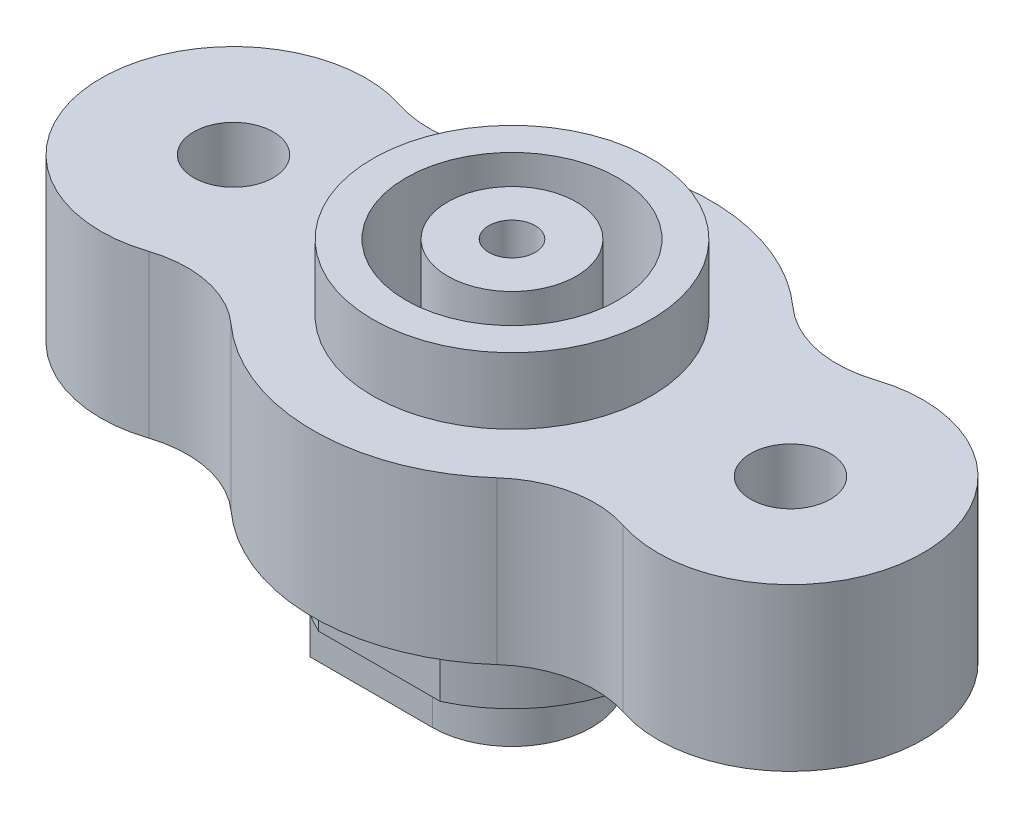
ISO-10303-21;
HEADER;
FILE_DESCRIPTION(('STEP AP214'),'2;1');
FILE_NAME('part.step','',(''),(''),'','','');
FILE_SCHEMA(('AUTOMOTIVE_DESIGN { 1 0 10303 214 1 1 1 1 }'));
ENDSEC;
DATA;
#1=APPLICATION_CONTEXT('core data for automotive mechanical design processes');
#2=APPLICATION_PROTOCOL_DEFINITION('international standard','automotive_design',2000,#1);
#3=PRODUCT_CONTEXT('',#1,'mechanical');
#4=PRODUCT('Part','Part','',(#3));
#5=PRODUCT_RELATED_PRODUCT_CATEGORY('part','',(#4));
#6=PRODUCT_DEFINITION_FORMATION('','',#4);
#7=PRODUCT_DEFINITION_CONTEXT('part definition',#1,'design');
#8=PRODUCT_DEFINITION('design','',#6,#7);
#9=PRODUCT_DEFINITION_SHAPE('','',#8);
#10=(LENGTH_UNIT() NAMED_UNIT(*) SI_UNIT(.MILLI.,.METRE.));
#11=(NAMED_UNIT(*) PLANE_ANGLE_UNIT() SI_UNIT($,.RADIAN.));
#12=(NAMED_UNIT(*) SI_UNIT($,.STERADIAN.) SOLID_ANGLE_UNIT());
#13=UNCERTAINTY_MEASURE_WITH_UNIT(LENGTH_MEASURE(1.E-05),#10,'distance_accuracy_value','');
#14=(GEOMETRIC_REPRESENTATION_CONTEXT(3) GLOBAL_UNCERTAINTY_ASSIGNED_CONTEXT((#13)) GLOBAL_UNIT_ASSIGNED_CONTEXT((#10,
#11,#12)) REPRESENTATION_CONTEXT('',''));
#15=CARTESIAN_POINT('',(0.,0.,0.));
#16=DIRECTION('',(0.,0.,1.));
#17=DIRECTION('',(1.,0.,0.));
#18=AXIS2_PLACEMENT_3D('',#15,#16,#17);
#19=CARTESIAN_POINT('',(0.,0.,0.));
#20=DIRECTION('',(0.,1.,0.));
#21=DIRECTION('',(0.,0.,1.));
#22=AXIS2_PLACEMENT_3D('',#19,#20,#21);
#23=PLANE('',#22);
#24=CARTESIAN_POINT('',(10.5,0.,0.));
#25=DIRECTION('',(0.,1.,0.));
#26=DIRECTION('',(0.,0.,1.));
#27=AXIS2_PLACEMENT_3D('',#24,#25,#26);
#28=CIRCLE('',#27,1.5);
#29=CARTESIAN_POINT('',(10.5,0.,1.5));
#30=VERTEX_POINT('',#29);
#31=EDGE_CURVE('E237',#30,#30,#28,.F.);
#32=ORIENTED_EDGE('',*,*,#31,.F.);
#33=EDGE_LOOP('',(#32));
#34=FACE_BOUND('',#33,.T.);
#35=CARTESIAN_POINT('',(-10.5,0.,0.));
#36=DIRECTION('',(0.,1.,0.));
#37=DIRECTION('',(0.,0.,1.));
#38=AXIS2_PLACEMENT_3D('',#35,#36,#37);
#39=CIRCLE('',#38,5.);
#40=CARTESIAN_POINT('',(-8.93915343915344,0.,-4.75013242062718));
#41=VERTEX_POINT('',#40);
#42=CARTESIAN_POINT('',(-8.93915343915344,0.,4.75013242062718));
#43=VERTEX_POINT('',#42);
#44=EDGE_CURVE('E253',#41,#43,#39,.T.);
#45=ORIENTED_EDGE('',*,*,#44,.F.);
#46=CARTESIAN_POINT('',(-7.69047619047619,0.,-8.55023835712893));
#47=DIRECTION('',(0.,1.,0.));
#48=DIRECTION('',(0.,0.,1.));
#49=AXIS2_PLACEMENT_3D('',#46,#47,#48);
#50=CIRCLE('',#49,4.);
#51=CARTESIAN_POINT('',(-5.01552795031056,0.,-5.57624240682321));
#52=VERTEX_POINT('',#51);
#53=EDGE_CURVE('E49',#41,#52,#50,.T.);
#54=ORIENTED_EDGE('',*,*,#53,.T.);
#55=CARTESIAN_POINT('',(0.,0.,0.));
#56=DIRECTION('',(0.,1.,0.));
#57=DIRECTION('',(0.,0.,1.));
#58=AXIS2_PLACEMENT_3D('',#55,#56,#57);
#59=CIRCLE('',#58,7.5);
#60=CARTESIAN_POINT('',(5.01552795031056,0.,-5.57624240682321));
#61=VERTEX_POINT('',#60);
#62=EDGE_CURVE('E257',#61,#52,#59,.T.);
#63=ORIENTED_EDGE('',*,*,#62,.F.);
#64=CARTESIAN_POINT('',(7.69047619047619,0.,-8.55023835712893));
#65=DIRECTION('',(0.,1.,0.));
#66=DIRECTION('',(0.,0.,1.));
#67=AXIS2_PLACEMENT_3D('',#64,#65,#66);
#68=CIRCLE('',#67,4.);
#69=CARTESIAN_POINT('',(8.93915343915344,0.,-4.75013242062718));
#70=VERTEX_POINT('',#69);
#71=EDGE_CURVE('E292',#61,#70,#68,.T.);
#72=ORIENTED_EDGE('',*,*,#71,.T.);
#73=CARTESIAN_POINT('',(10.5,0.,0.));
#74=DIRECTION('',(0.,1.,0.));
#75=DIRECTION('',(0.,0.,1.));
#76=AXIS2_PLACEMENT_3D('',#73,#74,#75);
#77=CIRCLE('',#76,5.);
#78=CARTESIAN_POINT('',(8.93915343915344,0.,4.75013242062718));
#79=VERTEX_POINT('',#78);
#80=EDGE_CURVE('E260',#70,#79,#77,.F.);
#81=ORIENTED_EDGE('',*,*,#80,.T.);
#82=CARTESIAN_POINT('',(7.69047619047619,0.,8.55023835712893));
#83=DIRECTION('',(0.,1.,0.));
#84=DIRECTION('',(0.,0.,1.));
#85=AXIS2_PLACEMENT_3D('',#82,#83,#84);
#86=CIRCLE('',#85,4.);
#87=CARTESIAN_POINT('',(5.01552795031056,0.,5.57624240682321));
#88=VERTEX_POINT('',#87);
#89=EDGE_CURVE('E284',#79,#88,#86,.T.);
#90=ORIENTED_EDGE('',*,*,#89,.T.);
#91=CARTESIAN_POINT('',(-5.01552795031056,0.,5.57624240682321));
#92=VERTEX_POINT('',#91);
#93=EDGE_CURVE('E256',#92,#88,#59,.T.);
#94=ORIENTED_EDGE('',*,*,#93,.F.);
#95=CARTESIAN_POINT('',(-7.69047619047619,0.,8.55023835712893));
#96=DIRECTION('',(0.,1.,0.));
#97=DIRECTION('',(0.,0.,1.));
#98=AXIS2_PLACEMENT_3D('',#95,#96,#97);
#99=CIRCLE('',#98,4.);
#100=EDGE_CURVE('E288',#92,#43,#99,.T.);
#101=ORIENTED_EDGE('',*,*,#100,.T.);
#102=EDGE_LOOP('',(#45,#54,#63,#72,#81,#90,#94,#101));
#103=FACE_BOUND('',#102,.T.);
#104=CARTESIAN_POINT('',(-10.5,0.,0.));
#105=DIRECTION('',(0.,1.,0.));
#106=DIRECTION('',(0.,0.,1.));
#107=AXIS2_PLACEMENT_3D('',#104,#105,#106);
#108=CIRCLE('',#107,1.5);
#109=CARTESIAN_POINT('',(-10.5,0.,1.5));
#110=VERTEX_POINT('',#109);
#111=EDGE_CURVE('E230',#110,#110,#108,.T.);
#112=ORIENTED_EDGE('',*,*,#111,.T.);
#113=EDGE_LOOP('',(#112));
#114=FACE_BOUND('',#113,.T.);
#115=CARTESIAN_POINT('',(0.,0.,0.));
#116=DIRECTION('',(0.,-1.,0.));
#117=DIRECTION('',(0.,0.,-1.));
#118=AXIS2_PLACEMENT_3D('',#115,#116,#117);
#119=CIRCLE('',#118,5.5);
#120=CARTESIAN_POINT('',(-2.29128784747792,0.,5.));
#121=VERTEX_POINT('',#120);
#122=CARTESIAN_POINT('',(-2.29128784747792,0.,-5.));
#123=VERTEX_POINT('',#122);
#124=EDGE_CURVE('E212',#121,#123,#119,.T.);
#125=ORIENTED_EDGE('',*,*,#124,.F.);
#126=DIRECTION('',(-1.,0.,0.));
#127=VECTOR('',#126,1.);
#128=CARTESIAN_POINT('',(0.,0.,5.));
#129=LINE('',#128,#127);
#130=CARTESIAN_POINT('',(2.29128784747792,0.,5.));
#131=VERTEX_POINT('',#130);
#132=EDGE_CURVE('E211',#131,#121,#129,.T.);
#133=ORIENTED_EDGE('',*,*,#132,.F.);
#134=CARTESIAN_POINT('',(2.29128784747792,0.,-5.));
#135=VERTEX_POINT('',#134);
#136=EDGE_CURVE('E208',#135,#131,#119,.T.);
#137=ORIENTED_EDGE('',*,*,#136,.F.);
#138=DIRECTION('',(-1.,0.,0.));
#139=VECTOR('',#138,1.);
#140=CARTESIAN_POINT('',(0.,0.,-5.));
#141=LINE('',#140,#139);
#142=EDGE_CURVE('E191',#135,#123,#141,.T.);
#143=ORIENTED_EDGE('',*,*,#142,.T.);
#144=EDGE_LOOP('',(#125,#133,#137,#143));
#145=FACE_BOUND('',#144,.T.);
#146=ADVANCED_FACE('F41',(#34,#103,#114,#145),#23,.F.);
#147=CARTESIAN_POINT('',(-10.5,6.1,0.));
#148=DIRECTION('',(0.,-1.,0.));
#149=DIRECTION('',(0.,0.,-1.));
#150=AXIS2_PLACEMENT_3D('',#147,#148,#149);
#151=CYLINDRICAL_SURFACE('',#150,5.);
#152=ORIENTED_EDGE('',*,*,#44,.T.);
#153=DIRECTION('',(0.,-1.,0.));
#154=VECTOR('',#153,1.);
#155=CARTESIAN_POINT('',(-8.93915343915344,6.1,4.75013242062718));
#156=LINE('',#155,#154);
#157=CARTESIAN_POINT('',(-8.93915343915344,6.1,4.75013242062718));
#158=VERTEX_POINT('',#157);
#159=EDGE_CURVE('E277',#43,#158,#156,.F.);
#160=ORIENTED_EDGE('',*,*,#159,.T.);
#161=CARTESIAN_POINT('',(-10.5,6.1,0.));
#162=DIRECTION('',(0.,1.,0.));
#163=DIRECTION('',(0.,0.,1.));
#164=AXIS2_PLACEMENT_3D('',#161,#162,#163);
#165=CIRCLE('',#164,5.);
#166=CARTESIAN_POINT('',(-8.93915343915344,6.1,-4.75013242062718));
#167=VERTEX_POINT('',#166);
#168=EDGE_CURVE('E236',#167,#158,#165,.T.);
#169=ORIENTED_EDGE('',*,*,#168,.F.);
#170=DIRECTION('',(0.,-1.,0.));
#171=VECTOR('',#170,1.);
#172=CARTESIAN_POINT('',(-8.93915343915344,6.1,-4.75013242062718));
#173=LINE('',#172,#171);
#174=EDGE_CURVE('E274',#167,#41,#173,.T.);
#175=ORIENTED_EDGE('',*,*,#174,.T.);
#176=EDGE_LOOP('',(#152,#160,#169,#175));
#177=FACE_BOUND('',#176,.T.);
#178=ADVANCED_FACE('F313',(#177),#151,.T.);
#179=CARTESIAN_POINT('',(0.,6.1,0.));
#180=DIRECTION('',(0.,-1.,0.));
#181=DIRECTION('',(0.,0.,-1.));
#182=AXIS2_PLACEMENT_3D('',#179,#180,#181);
#183=CYLINDRICAL_SURFACE('',#182,7.5);
#184=ORIENTED_EDGE('',*,*,#93,.T.);
#185=DIRECTION('',(0.,-1.,0.));
#186=VECTOR('',#185,1.);
#187=CARTESIAN_POINT('',(5.01552795031056,6.1,5.57624240682321));
#188=LINE('',#187,#186);
#189=CARTESIAN_POINT('',(5.01552795031056,6.1,5.57624240682321));
#190=VERTEX_POINT('',#189);
#191=EDGE_CURVE('E272',#88,#190,#188,.F.);
#192=ORIENTED_EDGE('',*,*,#191,.T.);
#193=CARTESIAN_POINT('',(0.,6.1,0.));
#194=DIRECTION('',(0.,1.,0.));
#195=DIRECTION('',(0.,0.,1.));
#196=AXIS2_PLACEMENT_3D('',#193,#194,#195);
#197=CIRCLE('',#196,7.5);
#198=CARTESIAN_POINT('',(-5.01552795031056,6.1,5.57624240682321));
#199=VERTEX_POINT('',#198);
#200=EDGE_CURVE('E240',#199,#190,#197,.T.);
#201=ORIENTED_EDGE('',*,*,#200,.F.);
#202=DIRECTION('',(0.,-1.,0.));
#203=VECTOR('',#202,1.);
#204=CARTESIAN_POINT('',(-5.01552795031056,6.1,5.57624240682321));
#205=LINE('',#204,#203);
#206=EDGE_CURVE('E269',#199,#92,#205,.T.);
#207=ORIENTED_EDGE('',*,*,#206,.T.);
#208=EDGE_LOOP('',(#184,#192,#201,#207));
#209=FACE_BOUND('',#208,.T.);
#210=ADVANCED_FACE('F323',(#209),#183,.T.);
#211=CARTESIAN_POINT('',(10.5,6.1,0.));
#212=DIRECTION('',(0.,-1.,0.));
#213=DIRECTION('',(0.,0.,-1.));
#214=AXIS2_PLACEMENT_3D('',#211,#212,#213);
#215=CYLINDRICAL_SURFACE('',#214,5.);
#216=CARTESIAN_POINT('',(10.5,6.1,0.));
#217=DIRECTION('',(0.,1.,0.));
#218=DIRECTION('',(0.,0.,1.));
#219=AXIS2_PLACEMENT_3D('',#216,#217,#218);
#220=CIRCLE('',#219,5.);
#221=CARTESIAN_POINT('',(8.93915343915344,6.1,-4.75013242062718));
#222=VERTEX_POINT('',#221);
#223=CARTESIAN_POINT('',(8.93915343915344,6.1,4.75013242062718));
#224=VERTEX_POINT('',#223);
#225=EDGE_CURVE('E245',#222,#224,#220,.F.);
#226=ORIENTED_EDGE('',*,*,#225,.T.);
#227=DIRECTION('',(0.,-1.,0.));
#228=VECTOR('',#227,1.);
#229=CARTESIAN_POINT('',(8.93915343915344,6.1,4.75013242062718));
#230=LINE('',#229,#228);
#231=EDGE_CURVE('E266',#224,#79,#230,.T.);
#232=ORIENTED_EDGE('',*,*,#231,.T.);
#233=ORIENTED_EDGE('',*,*,#80,.F.);
#234=DIRECTION('',(0.,-1.,0.));
#235=VECTOR('',#234,1.);
#236=CARTESIAN_POINT('',(8.93915343915344,6.1,-4.75013242062718));
#237=LINE('',#236,#235);
#238=EDGE_CURVE('E250',#70,#222,#237,.F.);
#239=ORIENTED_EDGE('',*,*,#238,.T.);
#240=EDGE_LOOP('',(#226,#232,#233,#239));
#241=FACE_BOUND('',#240,.T.);
#242=ADVANCED_FACE('F332',(#241),#215,.T.);
#243=CARTESIAN_POINT('',(5.01552795031056,6.1,-5.57624240682321));
#244=VERTEX_POINT('',#243);
#245=CARTESIAN_POINT('',(-5.01552795031056,6.1,-5.57624240682321));
#246=VERTEX_POINT('',#245);
#247=EDGE_CURVE('E241',#244,#246,#197,.T.);
#248=ORIENTED_EDGE('',*,*,#247,.F.);
#249=DIRECTION('',(0.,-1.,0.));
#250=VECTOR('',#249,1.);
#251=CARTESIAN_POINT('',(5.01552795031056,6.1,-5.57624240682321));
#252=LINE('',#251,#250);
#253=EDGE_CURVE('E281',#244,#61,#252,.T.);
#254=ORIENTED_EDGE('',*,*,#253,.T.);
#255=ORIENTED_EDGE('',*,*,#62,.T.);
#256=DIRECTION('',(0.,-1.,0.));
#257=VECTOR('',#256,1.);
#258=CARTESIAN_POINT('',(-5.01552795031056,6.1,-5.57624240682321));
#259=LINE('',#258,#257);
#260=EDGE_CURVE('E279',#52,#246,#259,.F.);
#261=ORIENTED_EDGE('',*,*,#260,.T.);
#262=EDGE_LOOP('',(#248,#254,#255,#261));
#263=FACE_BOUND('',#262,.T.);
#264=ADVANCED_FACE('F304',(#263),#183,.T.);
#265=CARTESIAN_POINT('',(-10.5,6.1,0.));
#266=DIRECTION('',(0.,-1.,0.));
#267=DIRECTION('',(0.,0.,-1.));
#268=AXIS2_PLACEMENT_3D('',#265,#266,#267);
#269=CYLINDRICAL_SURFACE('',#268,1.5);
#270=CARTESIAN_POINT('',(-10.5,6.1,0.));
#271=DIRECTION('',(0.,1.,0.));
#272=DIRECTION('',(0.,0.,1.));
#273=AXIS2_PLACEMENT_3D('',#270,#271,#272);
#274=CIRCLE('',#273,1.5);
#275=CARTESIAN_POINT('',(-10.5,6.1,1.5));
#276=VERTEX_POINT('',#275);
#277=EDGE_CURVE('E233',#276,#276,#274,.T.);
#278=ORIENTED_EDGE('',*,*,#277,.T.);
#279=EDGE_LOOP('',(#278));
#280=FACE_BOUND('',#279,.T.);
#281=ORIENTED_EDGE('',*,*,#111,.F.);
#282=EDGE_LOOP('',(#281));
#283=FACE_BOUND('',#282,.T.);
#284=ADVANCED_FACE('F357',(#280,#283),#269,.F.);
#285=CARTESIAN_POINT('',(10.5,6.1,0.));
#286=DIRECTION('',(0.,-1.,0.));
#287=DIRECTION('',(0.,0.,-1.));
#288=AXIS2_PLACEMENT_3D('',#285,#286,#287);
#289=CYLINDRICAL_SURFACE('',#288,1.5);
#290=CARTESIAN_POINT('',(10.5,6.1,0.));
#291=DIRECTION('',(0.,1.,0.));
#292=DIRECTION('',(0.,0.,1.));
#293=AXIS2_PLACEMENT_3D('',#290,#291,#292);
#294=CIRCLE('',#293,1.5);
#295=CARTESIAN_POINT('',(10.5,6.1,1.5));
#296=VERTEX_POINT('',#295);
#297=EDGE_CURVE('E244',#296,#296,#294,.F.);
#298=ORIENTED_EDGE('',*,*,#297,.F.);
#299=EDGE_LOOP('',(#298));
#300=FACE_BOUND('',#299,.T.);
#301=ORIENTED_EDGE('',*,*,#31,.T.);
#302=EDGE_LOOP('',(#301));
#303=FACE_BOUND('',#302,.T.);
#304=ADVANCED_FACE('F354',(#300,#303),#289,.F.);
#305=CARTESIAN_POINT('',(0.,6.1,0.));
#306=DIRECTION('',(0.,1.,0.));
#307=DIRECTION('',(0.,0.,1.));
#308=AXIS2_PLACEMENT_3D('',#305,#306,#307);
#309=PLANE('',#308);
#310=CARTESIAN_POINT('',(0.,6.1,0.));
#311=DIRECTION('',(0.,1.,0.));
#312=DIRECTION('',(0.,0.,1.));
#313=AXIS2_PLACEMENT_3D('',#310,#311,#312);
#314=CIRCLE('',#313,5.25);
#315=CARTESIAN_POINT('',(0.,6.1,5.25));
#316=VERTEX_POINT('',#315);
#317=EDGE_CURVE('E205',#316,#316,#314,.T.);
#318=ORIENTED_EDGE('',*,*,#317,.F.);
#319=EDGE_LOOP('',(#318));
#320=FACE_BOUND('',#319,.T.);
#321=ORIENTED_EDGE('',*,*,#277,.F.);
#322=EDGE_LOOP('',(#321));
#323=FACE_BOUND('',#322,.T.);
#324=ORIENTED_EDGE('',*,*,#247,.T.);
#325=CARTESIAN_POINT('',(-7.69047619047619,6.1,-8.55023835712893));
#326=DIRECTION('',(0.,1.,0.));
#327=DIRECTION('',(0.,0.,1.));
#328=AXIS2_PLACEMENT_3D('',#325,#326,#327);
#329=CIRCLE('',#328,4.);
#330=EDGE_CURVE('E13',#246,#167,#329,.F.);
#331=ORIENTED_EDGE('',*,*,#330,.T.);
#332=ORIENTED_EDGE('',*,*,#168,.T.);
#333=CARTESIAN_POINT('',(-7.69047619047619,6.1,8.55023835712893));
#334=DIRECTION('',(0.,1.,0.));
#335=DIRECTION('',(0.,0.,1.));
#336=AXIS2_PLACEMENT_3D('',#333,#334,#335);
#337=CIRCLE('',#336,4.);
#338=EDGE_CURVE('E290',#158,#199,#337,.F.);
#339=ORIENTED_EDGE('',*,*,#338,.T.);
#340=ORIENTED_EDGE('',*,*,#200,.T.);
#341=CARTESIAN_POINT('',(7.69047619047619,6.1,8.55023835712893));
#342=DIRECTION('',(0.,1.,0.));
#343=DIRECTION('',(0.,0.,1.));
#344=AXIS2_PLACEMENT_3D('',#341,#342,#343);
#345=CIRCLE('',#344,4.);
#346=EDGE_CURVE('E286',#190,#224,#345,.F.);
#347=ORIENTED_EDGE('',*,*,#346,.T.);
#348=ORIENTED_EDGE('',*,*,#225,.F.);
#349=CARTESIAN_POINT('',(7.69047619047619,6.1,-8.55023835712893));
#350=DIRECTION('',(0.,1.,0.));
#351=DIRECTION('',(0.,0.,1.));
#352=AXIS2_PLACEMENT_3D('',#349,#350,#351);
#353=CIRCLE('',#352,4.);
#354=EDGE_CURVE('E294',#222,#244,#353,.F.);
#355=ORIENTED_EDGE('',*,*,#354,.T.);
#356=EDGE_LOOP('',(#324,#331,#332,#339,#340,#347,#348,#355));
#357=FACE_BOUND('',#356,.T.);
#358=ORIENTED_EDGE('',*,*,#297,.T.);
#359=EDGE_LOOP('',(#358));
#360=FACE_BOUND('',#359,.T.);
#361=ADVANCED_FACE('F309',(#320,#323,#357,#360),#309,.T.);
#362=CARTESIAN_POINT('',(0.,8.6,0.));
#363=DIRECTION('',(0.,-1.,0.));
#364=DIRECTION('',(0.,0.,-1.));
#365=AXIS2_PLACEMENT_3D('',#362,#363,#364);
#366=CYLINDRICAL_SURFACE('',#365,5.25);
#367=CARTESIAN_POINT('',(0.,8.6,0.));
#368=DIRECTION('',(0.,1.,0.));
#369=DIRECTION('',(0.,0.,1.));
#370=AXIS2_PLACEMENT_3D('',#367,#368,#369);
#371=CIRCLE('',#370,5.25);
#372=CARTESIAN_POINT('',(0.,8.6,5.25));
#373=VERTEX_POINT('',#372);
#374=EDGE_CURVE('E227',#373,#373,#371,.T.);
#375=ORIENTED_EDGE('',*,*,#374,.F.);
#376=EDGE_LOOP('',(#375));
#377=FACE_BOUND('',#376,.T.);
#378=ORIENTED_EDGE('',*,*,#317,.T.);
#379=EDGE_LOOP('',(#378));
#380=FACE_BOUND('',#379,.T.);
#381=ADVANCED_FACE('F413',(#377,#380),#366,.T.);
#382=CARTESIAN_POINT('',(0.,8.6,0.));
#383=DIRECTION('',(0.,1.,0.));
#384=DIRECTION('',(0.,0.,1.));
#385=AXIS2_PLACEMENT_3D('',#382,#383,#384);
#386=PLANE('',#385);
#387=CARTESIAN_POINT('',(0.,8.6,0.));
#388=DIRECTION('',(0.,1.,0.));
#389=DIRECTION('',(0.,0.,1.));
#390=AXIS2_PLACEMENT_3D('',#387,#388,#389);
#391=CIRCLE('',#390,4.);
#392=CARTESIAN_POINT('',(0.,8.6,4.));
#393=VERTEX_POINT('',#392);
#394=EDGE_CURVE('E188',#393,#393,#391,.T.);
#395=ORIENTED_EDGE('',*,*,#394,.F.);
#396=EDGE_LOOP('',(#395));
#397=FACE_BOUND('',#396,.T.);
#398=ORIENTED_EDGE('',*,*,#374,.T.);
#399=EDGE_LOOP('',(#398));
#400=FACE_BOUND('',#399,.T.);
#401=ADVANCED_FACE('F403',(#397,#400),#386,.T.);
#402=CARTESIAN_POINT('',(0.,-29.1660687473185,0.));
#403=DIRECTION('',(0.,1.,0.));
#404=DIRECTION('',(0.,0.,1.));
#405=AXIS2_PLACEMENT_3D('',#402,#403,#404);
#406=CYLINDRICAL_SURFACE('',#405,5.5);
#407=DIRECTION('',(0.,1.,0.));
#408=VECTOR('',#407,1.);
#409=CARTESIAN_POINT('',(-2.29128784747792,-29.1660687473185,-5.));
#410=LINE('',#409,#408);
#411=CARTESIAN_POINT('',(-2.29128784747792,-2.85,-5.));
#412=VERTEX_POINT('',#411);
#413=EDGE_CURVE('E215',#412,#123,#410,.T.);
#414=ORIENTED_EDGE('',*,*,#413,.F.);
#415=CARTESIAN_POINT('',(0.,-2.85,0.));
#416=DIRECTION('',(0.,1.,0.));
#417=DIRECTION('',(0.,0.,1.));
#418=AXIS2_PLACEMENT_3D('',#415,#416,#417);
#419=CIRCLE('',#418,5.5);
#420=CARTESIAN_POINT('',(-4.60977222864644,-2.85,-3.));
#421=VERTEX_POINT('',#420);
#422=EDGE_CURVE('E200',#412,#421,#419,.T.);
#423=ORIENTED_EDGE('',*,*,#422,.T.);
#424=DIRECTION('',(0.,1.,0.));
#425=VECTOR('',#424,1.);
#426=CARTESIAN_POINT('',(-4.60977222864644,-5.85,-3.));
#427=LINE('',#426,#425);
#428=CARTESIAN_POINT('',(-4.60977222864644,-5.85,-3.));
#429=VERTEX_POINT('',#428);
#430=EDGE_CURVE('E177',#429,#421,#427,.T.);
#431=ORIENTED_EDGE('',*,*,#430,.F.);
#432=CARTESIAN_POINT('',(0.,-5.85,0.));
#433=DIRECTION('',(0.,-1.,0.));
#434=DIRECTION('',(0.,0.,-1.));
#435=AXIS2_PLACEMENT_3D('',#432,#433,#434);
#436=CIRCLE('',#435,5.5);
#437=CARTESIAN_POINT('',(-4.60977222864644,-5.85,3.));
#438=VERTEX_POINT('',#437);
#439=EDGE_CURVE('E160',#438,#429,#436,.T.);
#440=ORIENTED_EDGE('',*,*,#439,.F.);
#441=DIRECTION('',(0.,1.,0.));
#442=VECTOR('',#441,1.);
#443=CARTESIAN_POINT('',(-4.60977222864644,-5.85,3.));
#444=LINE('',#443,#442);
#445=CARTESIAN_POINT('',(-4.60977222864644,-2.85,3.));
#446=VERTEX_POINT('',#445);
#447=EDGE_CURVE('E157',#438,#446,#444,.T.);
#448=ORIENTED_EDGE('',*,*,#447,.T.);
#449=CARTESIAN_POINT('',(-2.29128784747792,-2.85,5.));
#450=VERTEX_POINT('',#449);
#451=EDGE_CURVE('E224',#446,#450,#419,.T.);
#452=ORIENTED_EDGE('',*,*,#451,.T.);
#453=DIRECTION('',(0.,1.,0.));
#454=VECTOR('',#453,1.);
#455=CARTESIAN_POINT('',(-2.29128784747792,-29.1660687473185,5.));
#456=LINE('',#455,#454);
#457=EDGE_CURVE('E218',#450,#121,#456,.T.);
#458=ORIENTED_EDGE('',*,*,#457,.T.);
#459=ORIENTED_EDGE('',*,*,#124,.T.);
#460=EDGE_LOOP('',(#414,#423,#431,#440,#448,#452,#458,#459));
#461=FACE_BOUND('',#460,.T.);
#462=ADVANCED_FACE('F399',(#461),#406,.T.);
#463=CARTESIAN_POINT('',(0.,-29.1660687473185,5.));
#464=DIRECTION('',(0.,0.,-1.));
#465=DIRECTION('',(-1.,0.,0.));
#466=AXIS2_PLACEMENT_3D('',#463,#464,#465);
#467=PLANE('',#466);
#468=ORIENTED_EDGE('',*,*,#457,.F.);
#469=DIRECTION('',(1.,0.,0.));
#470=VECTOR('',#469,1.);
#471=CARTESIAN_POINT('',(0.,-2.85,5.));
#472=LINE('',#471,#470);
#473=CARTESIAN_POINT('',(2.29128784747792,-2.85,5.));
#474=VERTEX_POINT('',#473);
#475=EDGE_CURVE('E196',#450,#474,#472,.T.);
#476=ORIENTED_EDGE('',*,*,#475,.T.);
#477=DIRECTION('',(0.,1.,0.));
#478=VECTOR('',#477,1.);
#479=CARTESIAN_POINT('',(2.29128784747792,-29.1660687473185,5.));
#480=LINE('',#479,#478);
#481=EDGE_CURVE('E220',#474,#131,#480,.T.);
#482=ORIENTED_EDGE('',*,*,#481,.T.);
#483=ORIENTED_EDGE('',*,*,#132,.T.);
#484=EDGE_LOOP('',(#468,#476,#482,#483));
#485=FACE_BOUND('',#484,.T.);
#486=ADVANCED_FACE('F402',(#485),#467,.F.);
#487=ORIENTED_EDGE('',*,*,#481,.F.);
#488=CARTESIAN_POINT('',(0.,-2.85,0.));
#489=DIRECTION('',(0.,1.,0.));
#490=DIRECTION('',(0.,0.,1.));
#491=AXIS2_PLACEMENT_3D('',#488,#489,#490);
#492=CIRCLE('',#491,5.5);
#493=CARTESIAN_POINT('',(2.29128784747792,-2.85,-5.));
#494=VERTEX_POINT('',#493);
#495=EDGE_CURVE('E199',#474,#494,#492,.T.);
#496=ORIENTED_EDGE('',*,*,#495,.T.);
#497=DIRECTION('',(0.,1.,0.));
#498=VECTOR('',#497,1.);
#499=CARTESIAN_POINT('',(2.29128784747792,-29.1660687473185,-5.));
#500=LINE('',#499,#498);
#501=EDGE_CURVE('E222',#494,#135,#500,.T.);
#502=ORIENTED_EDGE('',*,*,#501,.T.);
#503=ORIENTED_EDGE('',*,*,#136,.T.);
#504=EDGE_LOOP('',(#487,#496,#502,#503));
#505=FACE_BOUND('',#504,.T.);
#506=ADVANCED_FACE('F405',(#505),#406,.T.);
#507=CARTESIAN_POINT('',(0.,-29.1660687473185,-5.));
#508=DIRECTION('',(0.,0.,-1.));
#509=DIRECTION('',(-1.,0.,0.));
#510=AXIS2_PLACEMENT_3D('',#507,#508,#509);
#511=PLANE('',#510);
#512=DIRECTION('',(1.,0.,0.));
#513=VECTOR('',#512,1.);
#514=CARTESIAN_POINT('',(0.,-2.85,-5.));
#515=LINE('',#514,#513);
#516=EDGE_CURVE('E203',#412,#494,#515,.T.);
#517=ORIENTED_EDGE('',*,*,#516,.F.);
#518=ORIENTED_EDGE('',*,*,#413,.T.);
#519=ORIENTED_EDGE('',*,*,#142,.F.);
#520=ORIENTED_EDGE('',*,*,#501,.F.);
#521=EDGE_LOOP('',(#517,#518,#519,#520));
#522=FACE_BOUND('',#521,.T.);
#523=ADVANCED_FACE('F398',(#522),#511,.T.);
#524=CARTESIAN_POINT('',(0.,-2.85,0.));
#525=DIRECTION('',(0.,1.,0.));
#526=DIRECTION('',(0.,0.,1.));
#527=AXIS2_PLACEMENT_3D('',#524,#525,#526);
#528=PLANE('',#527);
#529=CARTESIAN_POINT('',(0.,-2.85,0.));
#530=DIRECTION('',(0.,-1.,0.));
#531=DIRECTION('',(0.,0.,-1.));
#532=AXIS2_PLACEMENT_3D('',#529,#530,#531);
#533=CIRCLE('',#532,3.);
#534=CARTESIAN_POINT('',(0.,-2.85,-3.));
#535=VERTEX_POINT('',#534);
#536=CARTESIAN_POINT('',(0.,-2.85,3.));
#537=VERTEX_POINT('',#536);
#538=EDGE_CURVE('E56',#535,#537,#533,.T.);
#539=ORIENTED_EDGE('',*,*,#538,.F.);
#540=DIRECTION('',(-1.,0.,0.));
#541=VECTOR('',#540,1.);
#542=CARTESIAN_POINT('',(0.,-2.85,-3.));
#543=LINE('',#542,#541);
#544=EDGE_CURVE('E169',#535,#421,#543,.T.);
#545=ORIENTED_EDGE('',*,*,#544,.T.);
#546=ORIENTED_EDGE('',*,*,#422,.F.);
#547=ORIENTED_EDGE('',*,*,#516,.T.);
#548=ORIENTED_EDGE('',*,*,#495,.F.);
#549=ORIENTED_EDGE('',*,*,#475,.F.);
#550=ORIENTED_EDGE('',*,*,#451,.F.);
#551=DIRECTION('',(-1.,0.,0.));
#552=VECTOR('',#551,1.);
#553=CARTESIAN_POINT('',(0.,-2.85,3.));
#554=LINE('',#553,#552);
#555=EDGE_CURVE('E61',#537,#446,#554,.T.);
#556=ORIENTED_EDGE('',*,*,#555,.F.);
#557=EDGE_LOOP('',(#539,#545,#546,#547,#548,#549,#550,#556));
#558=FACE_BOUND('',#557,.T.);
#559=ADVANCED_FACE('F394',(#558),#528,.F.);
#560=CARTESIAN_POINT('',(0.,0.6,0.));
#561=DIRECTION('',(0.,1.,0.));
#562=DIRECTION('',(0.,0.,1.));
#563=AXIS2_PLACEMENT_3D('',#560,#561,#562);
#564=CYLINDRICAL_SURFACE('',#563,2.425);
#565=CARTESIAN_POINT('',(0.,0.6,0.));
#566=DIRECTION('',(0.,1.,0.));
#567=DIRECTION('',(0.,0.,1.));
#568=AXIS2_PLACEMENT_3D('',#565,#566,#567);
#569=CIRCLE('',#568,2.425);
#570=CARTESIAN_POINT('',(0.,0.6,2.425));
#571=VERTEX_POINT('',#570);
#572=EDGE_CURVE('E184',#571,#571,#569,.T.);
#573=ORIENTED_EDGE('',*,*,#572,.T.);
#574=EDGE_LOOP('',(#573));
#575=FACE_BOUND('',#574,.T.);
#576=CARTESIAN_POINT('',(0.,8.6,0.));
#577=DIRECTION('',(0.,1.,0.));
#578=DIRECTION('',(0.,0.,1.));
#579=AXIS2_PLACEMENT_3D('',#576,#577,#578);
#580=CIRCLE('',#579,2.425);
#581=CARTESIAN_POINT('',(0.,8.6,2.425));
#582=VERTEX_POINT('',#581);
#583=EDGE_CURVE('E182',#582,#582,#580,.T.);
#584=ORIENTED_EDGE('',*,*,#583,.F.);
#585=EDGE_LOOP('',(#584));
#586=FACE_BOUND('',#585,.T.);
#587=ADVANCED_FACE('F390',(#575,#586),#564,.T.);
#588=CARTESIAN_POINT('',(0.,0.6,0.));
#589=DIRECTION('',(0.,1.,0.));
#590=DIRECTION('',(0.,0.,1.));
#591=AXIS2_PLACEMENT_3D('',#588,#589,#590);
#592=CYLINDRICAL_SURFACE('',#591,4.);
#593=CARTESIAN_POINT('',(0.,0.6,0.));
#594=DIRECTION('',(0.,1.,0.));
#595=DIRECTION('',(0.,0.,1.));
#596=AXIS2_PLACEMENT_3D('',#593,#594,#595);
#597=CIRCLE('',#596,4.);
#598=CARTESIAN_POINT('',(0.,0.6,4.));
#599=VERTEX_POINT('',#598);
#600=EDGE_CURVE('E187',#599,#599,#597,.T.);
#601=ORIENTED_EDGE('',*,*,#600,.F.);
#602=EDGE_LOOP('',(#601));
#603=FACE_BOUND('',#602,.T.);
#604=ORIENTED_EDGE('',*,*,#394,.T.);
#605=EDGE_LOOP('',(#604));
#606=FACE_BOUND('',#605,.T.);
#607=ADVANCED_FACE('F386',(#603,#606),#592,.F.);
#608=CARTESIAN_POINT('',(0.,0.6,0.));
#609=DIRECTION('',(0.,1.,0.));
#610=DIRECTION('',(0.,0.,1.));
#611=AXIS2_PLACEMENT_3D('',#608,#609,#610);
#612=PLANE('',#611);
#613=ORIENTED_EDGE('',*,*,#572,.F.);
#614=EDGE_LOOP('',(#613));
#615=FACE_BOUND('',#614,.T.);
#616=ORIENTED_EDGE('',*,*,#600,.T.);
#617=EDGE_LOOP('',(#616));
#618=FACE_BOUND('',#617,.T.);
#619=ADVANCED_FACE('F383',(#615,#618),#612,.T.);
#620=CARTESIAN_POINT('',(0.,8.6,0.));
#621=DIRECTION('',(0.,1.,0.));
#622=DIRECTION('',(0.,0.,1.));
#623=AXIS2_PLACEMENT_3D('',#620,#621,#622);
#624=CIRCLE('',#623,0.875);
#625=CARTESIAN_POINT('',(0.,8.6,0.875));
#626=VERTEX_POINT('',#625);
#627=EDGE_CURVE('E172',#626,#626,#624,.T.);
#628=ORIENTED_EDGE('',*,*,#627,.F.);
#629=EDGE_LOOP('',(#628));
#630=FACE_BOUND('',#629,.T.);
#631=ORIENTED_EDGE('',*,*,#583,.T.);
#632=EDGE_LOOP('',(#631));
#633=FACE_BOUND('',#632,.T.);
#634=ADVANCED_FACE('F377',(#630,#633),#386,.T.);
#635=CARTESIAN_POINT('',(0.,0.6,0.));
#636=DIRECTION('',(0.,1.,0.));
#637=DIRECTION('',(0.,0.,1.));
#638=AXIS2_PLACEMENT_3D('',#635,#636,#637);
#639=CYLINDRICAL_SURFACE('',#638,0.875);
#640=CARTESIAN_POINT('',(0.,0.6,0.));
#641=DIRECTION('',(0.,1.,0.));
#642=DIRECTION('',(0.,0.,1.));
#643=AXIS2_PLACEMENT_3D('',#640,#641,#642);
#644=CIRCLE('',#643,0.875);
#645=CARTESIAN_POINT('',(0.,0.6,0.875));
#646=VERTEX_POINT('',#645);
#647=EDGE_CURVE('E175',#646,#646,#644,.T.);
#648=ORIENTED_EDGE('',*,*,#647,.F.);
#649=EDGE_LOOP('',(#648));
#650=FACE_BOUND('',#649,.T.);
#651=ORIENTED_EDGE('',*,*,#627,.T.);
#652=EDGE_LOOP('',(#651));
#653=FACE_BOUND('',#652,.T.);
#654=ADVANCED_FACE('F371',(#650,#653),#639,.F.);
#655=CARTESIAN_POINT('',(0.,0.6,0.));
#656=DIRECTION('',(0.,1.,0.));
#657=DIRECTION('',(0.,0.,1.));
#658=AXIS2_PLACEMENT_3D('',#655,#656,#657);
#659=PLANE('',#658);
#660=ORIENTED_EDGE('',*,*,#647,.T.);
#661=EDGE_LOOP('',(#660));
#662=FACE_BOUND('',#661,.T.);
#663=ADVANCED_FACE('F367',(#662),#659,.T.);
#664=CARTESIAN_POINT('',(7.69047619047619,6.1,8.55023835712893));
#665=DIRECTION('',(0.,1.,0.));
#666=DIRECTION('',(0.,0.,1.));
#667=AXIS2_PLACEMENT_3D('',#664,#665,#666);
#668=CYLINDRICAL_SURFACE('',#667,4.);
#669=ORIENTED_EDGE('',*,*,#346,.F.);
#670=ORIENTED_EDGE('',*,*,#191,.F.);
#671=ORIENTED_EDGE('',*,*,#89,.F.);
#672=ORIENTED_EDGE('',*,*,#231,.F.);
#673=EDGE_LOOP('',(#669,#670,#671,#672));
#674=FACE_BOUND('',#673,.T.);
#675=ADVANCED_FACE('F327',(#674),#668,.F.);
#676=CARTESIAN_POINT('',(-7.69047619047619,6.1,8.55023835712893));
#677=DIRECTION('',(0.,1.,0.));
#678=DIRECTION('',(0.,0.,1.));
#679=AXIS2_PLACEMENT_3D('',#676,#677,#678);
#680=CYLINDRICAL_SURFACE('',#679,4.);
#681=ORIENTED_EDGE('',*,*,#338,.F.);
#682=ORIENTED_EDGE('',*,*,#159,.F.);
#683=ORIENTED_EDGE('',*,*,#100,.F.);
#684=ORIENTED_EDGE('',*,*,#206,.F.);
#685=EDGE_LOOP('',(#681,#682,#683,#684));
#686=FACE_BOUND('',#685,.T.);
#687=ADVANCED_FACE('F316',(#686),#680,.F.);
#688=CARTESIAN_POINT('',(7.69047619047619,6.1,-8.55023835712893));
#689=DIRECTION('',(0.,1.,0.));
#690=DIRECTION('',(0.,0.,1.));
#691=AXIS2_PLACEMENT_3D('',#688,#689,#690);
#692=CYLINDRICAL_SURFACE('',#691,4.);
#693=ORIENTED_EDGE('',*,*,#354,.F.);
#694=ORIENTED_EDGE('',*,*,#238,.F.);
#695=ORIENTED_EDGE('',*,*,#71,.F.);
#696=ORIENTED_EDGE('',*,*,#253,.F.);
#697=EDGE_LOOP('',(#693,#694,#695,#696));
#698=FACE_BOUND('',#697,.T.);
#699=ADVANCED_FACE('F336',(#698),#692,.F.);
#700=CARTESIAN_POINT('',(-7.69047619047619,6.1,-8.55023835712893));
#701=DIRECTION('',(0.,1.,0.));
#702=DIRECTION('',(0.,0.,1.));
#703=AXIS2_PLACEMENT_3D('',#700,#701,#702);
#704=CYLINDRICAL_SURFACE('',#703,4.);
#705=ORIENTED_EDGE('',*,*,#330,.F.);
#706=ORIENTED_EDGE('',*,*,#260,.F.);
#707=ORIENTED_EDGE('',*,*,#53,.F.);
#708=ORIENTED_EDGE('',*,*,#174,.F.);
#709=EDGE_LOOP('',(#705,#706,#707,#708));
#710=FACE_BOUND('',#709,.T.);
#711=ADVANCED_FACE('F43',(#710),#704,.F.);
#712=CARTESIAN_POINT('',(0.,-5.85,0.));
#713=DIRECTION('',(0.,1.,0.));
#714=DIRECTION('',(0.,0.,1.));
#715=AXIS2_PLACEMENT_3D('',#712,#713,#714);
#716=CYLINDRICAL_SURFACE('',#715,3.);
#717=ORIENTED_EDGE('',*,*,#538,.T.);
#718=DIRECTION('',(0.,1.,0.));
#719=VECTOR('',#718,1.);
#720=CARTESIAN_POINT('',(0.,-5.85,3.));
#721=LINE('',#720,#719);
#722=CARTESIAN_POINT('',(0.,-5.85,3.));
#723=VERTEX_POINT('',#722);
#724=EDGE_CURVE('E155',#723,#537,#721,.T.);
#725=ORIENTED_EDGE('',*,*,#724,.F.);
#726=CARTESIAN_POINT('',(0.,-5.85,0.));
#727=DIRECTION('',(0.,-1.,0.));
#728=DIRECTION('',(0.,0.,-1.));
#729=AXIS2_PLACEMENT_3D('',#726,#727,#728);
#730=CIRCLE('',#729,3.);
#731=CARTESIAN_POINT('',(0.,-5.85,-3.));
#732=VERTEX_POINT('',#731);
#733=EDGE_CURVE('E161',#732,#723,#730,.T.);
#734=ORIENTED_EDGE('',*,*,#733,.F.);
#735=DIRECTION('',(0.,1.,0.));
#736=VECTOR('',#735,1.);
#737=CARTESIAN_POINT('',(0.,-5.85,-3.));
#738=LINE('',#737,#736);
#739=EDGE_CURVE('E444',#732,#535,#738,.T.);
#740=ORIENTED_EDGE('',*,*,#739,.T.);
#741=EDGE_LOOP('',(#717,#725,#734,#740));
#742=FACE_BOUND('',#741,.T.);
#743=ADVANCED_FACE('F171',(#742),#716,.T.);
#744=CARTESIAN_POINT('',(0.,-5.85,3.));
#745=DIRECTION('',(0.,0.,-1.));
#746=DIRECTION('',(-1.,0.,0.));
#747=AXIS2_PLACEMENT_3D('',#744,#745,#746);
#748=PLANE('',#747);
#749=ORIENTED_EDGE('',*,*,#555,.T.);
#750=ORIENTED_EDGE('',*,*,#447,.F.);
#751=DIRECTION('',(-1.,0.,0.));
#752=VECTOR('',#751,1.);
#753=CARTESIAN_POINT('',(0.,-5.85,3.));
#754=LINE('',#753,#752);
#755=EDGE_CURVE('E151',#723,#438,#754,.T.);
#756=ORIENTED_EDGE('',*,*,#755,.F.);
#757=ORIENTED_EDGE('',*,*,#724,.T.);
#758=EDGE_LOOP('',(#749,#750,#756,#757));
#759=FACE_BOUND('',#758,.T.);
#760=ADVANCED_FACE('F153',(#759),#748,.F.);
#761=CARTESIAN_POINT('',(0.,-5.85,-3.));
#762=DIRECTION('',(0.,0.,-1.));
#763=DIRECTION('',(-1.,0.,0.));
#764=AXIS2_PLACEMENT_3D('',#761,#762,#763);
#765=PLANE('',#764);
#766=ORIENTED_EDGE('',*,*,#544,.F.);
#767=ORIENTED_EDGE('',*,*,#739,.F.);
#768=DIRECTION('',(-1.,0.,0.));
#769=VECTOR('',#768,1.);
#770=CARTESIAN_POINT('',(0.,-5.85,-3.));
#771=LINE('',#770,#769);
#772=EDGE_CURVE('E167',#732,#429,#771,.T.);
#773=ORIENTED_EDGE('',*,*,#772,.T.);
#774=ORIENTED_EDGE('',*,*,#430,.T.);
#775=EDGE_LOOP('',(#766,#767,#773,#774));
#776=FACE_BOUND('',#775,.T.);
#777=ADVANCED_FACE('F443',(#776),#765,.T.);
#778=CARTESIAN_POINT('',(0.,-5.85,0.));
#779=DIRECTION('',(0.,-1.,0.));
#780=DIRECTION('',(0.,0.,-1.));
#781=AXIS2_PLACEMENT_3D('',#778,#779,#780);
#782=PLANE('',#781);
#783=ORIENTED_EDGE('',*,*,#733,.T.);
#784=ORIENTED_EDGE('',*,*,#755,.T.);
#785=ORIENTED_EDGE('',*,*,#439,.T.);
#786=ORIENTED_EDGE('',*,*,#772,.F.);
#787=EDGE_LOOP('',(#783,#784,#785,#786));
#788=FACE_BOUND('',#787,.T.);
#789=ADVANCED_FACE('F165',(#788),#782,.T.);
#790=CLOSED_SHELL('',(#146,#178,#210,#242,#264,#284,#304,#361,#381,#401,#462,#486,#506,#523,
#559,#587,#607,#619,#634,#654,#663,#675,#687,#699,#711,#743,#760,#777,#789));
#791=MANIFOLD_SOLID_BREP('B2',#790);
#792=ADVANCED_BREP_SHAPE_REPRESENTATION('',(#18,#791),#14);
#793=SHAPE_DEFINITION_REPRESENTATION(#9,#792);
ENDSEC;
END-ISO-10303-21;
